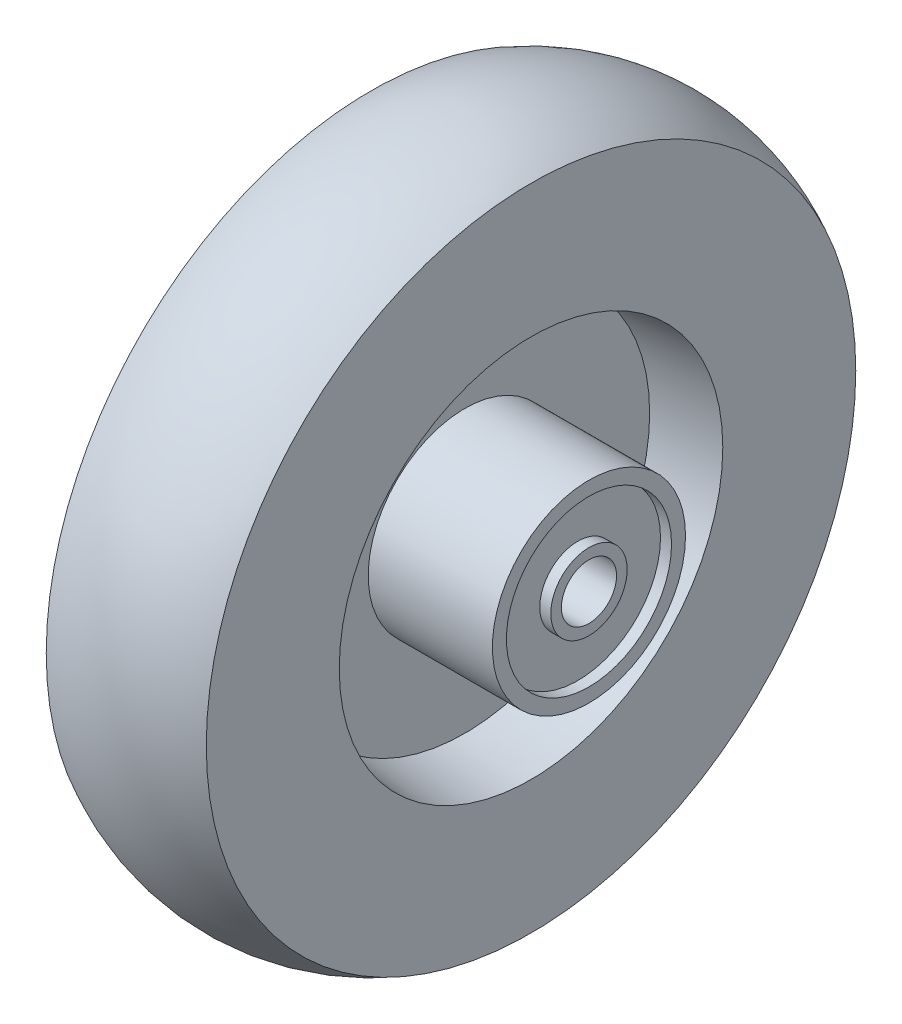
ISO-10303-21;
HEADER;
FILE_DESCRIPTION(('STEP AP214'),'2;1');
FILE_NAME('part.step','',(''),(''),'','','');
FILE_SCHEMA(('AUTOMOTIVE_DESIGN { 1 0 10303 214 1 1 1 1 }'));
ENDSEC;
DATA;
#1=APPLICATION_CONTEXT('core data for automotive mechanical design processes');
#2=APPLICATION_PROTOCOL_DEFINITION('international standard','automotive_design',2000,#1);
#3=PRODUCT_CONTEXT('',#1,'mechanical');
#4=PRODUCT('Part','Part','',(#3));
#5=PRODUCT_RELATED_PRODUCT_CATEGORY('part','',(#4));
#6=PRODUCT_DEFINITION_FORMATION('','',#4);
#7=PRODUCT_DEFINITION_CONTEXT('part definition',#1,'design');
#8=PRODUCT_DEFINITION('design','',#6,#7);
#9=PRODUCT_DEFINITION_SHAPE('','',#8);
#10=(LENGTH_UNIT() NAMED_UNIT(*) SI_UNIT(.MILLI.,.METRE.));
#11=(NAMED_UNIT(*) PLANE_ANGLE_UNIT() SI_UNIT($,.RADIAN.));
#12=(NAMED_UNIT(*) SI_UNIT($,.STERADIAN.) SOLID_ANGLE_UNIT());
#13=UNCERTAINTY_MEASURE_WITH_UNIT(LENGTH_MEASURE(1.E-05),#10,'distance_accuracy_value','');
#14=(GEOMETRIC_REPRESENTATION_CONTEXT(3) GLOBAL_UNCERTAINTY_ASSIGNED_CONTEXT((#13)) GLOBAL_UNIT_ASSIGNED_CONTEXT((#10,
#11,#12)) REPRESENTATION_CONTEXT('',''));
#15=CARTESIAN_POINT('',(0.,0.,0.));
#16=DIRECTION('',(0.,0.,1.));
#17=DIRECTION('',(1.,0.,0.));
#18=AXIS2_PLACEMENT_3D('',#15,#16,#17);
#19=CARTESIAN_POINT('',(-31.7499999999999,0.,-22.225));
#20=DIRECTION('',(-1.,0.,0.));
#21=DIRECTION('',(0.,0.,1.));
#22=AXIS2_PLACEMENT_3D('',#19,#20,#21);
#23=PLANE('',#22);
#24=CARTESIAN_POINT('',(-31.7500000000001,0.,0.));
#25=DIRECTION('',(1.,0.,0.));
#26=DIRECTION('',(0.,0.,-1.));
#27=AXIS2_PLACEMENT_3D('',#24,#25,#26);
#28=CIRCLE('',#27,22.225);
#29=CARTESIAN_POINT('',(-31.75,0.,-22.225));
#30=VERTEX_POINT('',#29);
#31=EDGE_CURVE('E10',#30,#30,#28,.T.);
#32=ORIENTED_EDGE('',*,*,#31,.F.);
#33=EDGE_LOOP('',(#32));
#34=FACE_BOUND('',#33,.T.);
#35=CARTESIAN_POINT('',(-31.75,0.,1.19944418344307E-13));
#36=DIRECTION('',(1.,0.,0.));
#37=DIRECTION('',(0.,0.,-1.));
#38=AXIS2_PLACEMENT_3D('',#35,#36,#37);
#39=CIRCLE('',#38,19.0018090386888);
#40=CARTESIAN_POINT('',(-31.75,0.,-19.0018090386887));
#41=VERTEX_POINT('',#40);
#42=EDGE_CURVE('E88',#41,#41,#39,.T.);
#43=ORIENTED_EDGE('',*,*,#42,.T.);
#44=EDGE_LOOP('',(#43));
#45=FACE_BOUND('',#44,.T.);
#46=ADVANCED_FACE('F31',(#34,#45),#23,.T.);
#47=CARTESIAN_POINT('',(-31.75,0.,0.));
#48=DIRECTION('',(1.,0.,0.));
#49=DIRECTION('',(0.,0.,-1.));
#50=AXIS2_PLACEMENT_3D('',#47,#48,#49);
#51=CYLINDRICAL_SURFACE('',#50,22.225);
#52=ORIENTED_EDGE('',*,*,#31,.T.);
#53=EDGE_LOOP('',(#52));
#54=FACE_BOUND('',#53,.T.);
#55=CARTESIAN_POINT('',(-3.17500000000006,0.,1.11838230097169E-13));
#56=DIRECTION('',(1.,0.,0.));
#57=DIRECTION('',(0.,0.,-1.));
#58=AXIS2_PLACEMENT_3D('',#55,#56,#57);
#59=CIRCLE('',#58,22.2250000000001);
#60=CARTESIAN_POINT('',(-3.17499999999998,0.,-22.225));
#61=VERTEX_POINT('',#60);
#62=EDGE_CURVE('E66',#61,#61,#59,.T.);
#63=ORIENTED_EDGE('',*,*,#62,.F.);
#64=EDGE_LOOP('',(#63));
#65=FACE_BOUND('',#64,.T.);
#66=ADVANCED_FACE('F33',(#54,#65),#51,.T.);
#67=CARTESIAN_POINT('',(-31.75,0.,1.19944418344307E-13));
#68=DIRECTION('',(1.,0.,0.));
#69=DIRECTION('',(0.,0.,-1.));
#70=AXIS2_PLACEMENT_3D('',#67,#68,#69);
#71=CIRCLE('',#70,8.78831894846454);
#72=CARTESIAN_POINT('',(-31.75,0.,-8.78831894846442));
#73=VERTEX_POINT('',#72);
#74=EDGE_CURVE('E94',#73,#73,#71,.T.);
#75=ORIENTED_EDGE('',*,*,#74,.F.);
#76=EDGE_LOOP('',(#75));
#77=FACE_BOUND('',#76,.T.);
#78=CARTESIAN_POINT('',(-31.7500000000003,0.,-1.19944418344308E-13));
#79=DIRECTION('',(1.,0.,0.));
#80=DIRECTION('',(0.,0.,-1.));
#81=AXIS2_PLACEMENT_3D('',#78,#79,#80);
#82=CIRCLE('',#81,6.35);
#83=CARTESIAN_POINT('',(-31.7500000000002,0.,-6.35000000000012));
#84=VERTEX_POINT('',#83);
#85=EDGE_CURVE('E79',#84,#84,#82,.T.);
#86=ORIENTED_EDGE('',*,*,#85,.T.);
#87=EDGE_LOOP('',(#86));
#88=FACE_BOUND('',#87,.T.);
#89=ADVANCED_FACE('F109',(#77,#88),#23,.T.);
#90=CARTESIAN_POINT('',(31.75,0.,-22.225));
#91=DIRECTION('',(1.,0.,0.));
#92=DIRECTION('',(0.,0.,-1.));
#93=AXIS2_PLACEMENT_3D('',#90,#91,#92);
#94=PLANE('',#93);
#95=CARTESIAN_POINT('',(31.75,0.,1.19944418344307E-13));
#96=DIRECTION('',(1.,0.,0.));
#97=DIRECTION('',(0.,0.,-1.));
#98=AXIS2_PLACEMENT_3D('',#95,#96,#97);
#99=CIRCLE('',#98,19.0018090386888);
#100=CARTESIAN_POINT('',(31.75,0.,-19.0018090386887));
#101=VERTEX_POINT('',#100);
#102=EDGE_CURVE('E70',#101,#101,#99,.T.);
#103=ORIENTED_EDGE('',*,*,#102,.F.);
#104=EDGE_LOOP('',(#103));
#105=FACE_BOUND('',#104,.T.);
#106=CARTESIAN_POINT('',(31.7499999999999,0.,2.43777090275907E-13));
#107=DIRECTION('',(1.,0.,0.));
#108=DIRECTION('',(0.,0.,-1.));
#109=AXIS2_PLACEMENT_3D('',#106,#107,#108);
#110=CIRCLE('',#109,22.2250000000002);
#111=CARTESIAN_POINT('',(31.75,0.,-22.225));
#112=VERTEX_POINT('',#111);
#113=EDGE_CURVE('E38',#112,#112,#110,.T.);
#114=ORIENTED_EDGE('',*,*,#113,.T.);
#115=EDGE_LOOP('',(#114));
#116=FACE_BOUND('',#115,.T.);
#117=ADVANCED_FACE('F112',(#105,#116),#94,.T.);
#118=CARTESIAN_POINT('',(-31.75,0.,0.));
#119=DIRECTION('',(1.,0.,0.));
#120=DIRECTION('',(0.,0.,-1.));
#121=AXIS2_PLACEMENT_3D('',#118,#119,#120);
#122=CYLINDRICAL_SURFACE('',#121,22.2250000000001);
#123=CARTESIAN_POINT('',(3.17499999999991,0.,1.3582711376603E-13));
#124=DIRECTION('',(1.,0.,0.));
#125=DIRECTION('',(0.,0.,-1.));
#126=AXIS2_PLACEMENT_3D('',#123,#124,#125);
#127=CIRCLE('',#126,22.2250000000001);
#128=CARTESIAN_POINT('',(3.175,0.,-22.225));
#129=VERTEX_POINT('',#128);
#130=EDGE_CURVE('E42',#129,#129,#127,.T.);
#131=ORIENTED_EDGE('',*,*,#130,.T.);
#132=EDGE_LOOP('',(#131));
#133=FACE_BOUND('',#132,.T.);
#134=ORIENTED_EDGE('',*,*,#113,.F.);
#135=EDGE_LOOP('',(#134));
#136=FACE_BOUND('',#135,.T.);
#137=ADVANCED_FACE('F146',(#133,#136),#122,.T.);
#138=CARTESIAN_POINT('',(3.17500000000004,0.,-42.545));
#139=DIRECTION('',(1.,0.,0.));
#140=DIRECTION('',(0.,0.,-1.));
#141=AXIS2_PLACEMENT_3D('',#138,#139,#140);
#142=PLANE('',#141);
#143=CARTESIAN_POINT('',(3.17499999999984,0.,1.3582711376603E-13));
#144=DIRECTION('',(1.,0.,0.));
#145=DIRECTION('',(0.,0.,-1.));
#146=AXIS2_PLACEMENT_3D('',#143,#144,#145);
#147=CIRCLE('',#146,42.5450000000001);
#148=CARTESIAN_POINT('',(3.175,0.,-42.545));
#149=VERTEX_POINT('',#148);
#150=EDGE_CURVE('E46',#149,#149,#147,.T.);
#151=ORIENTED_EDGE('',*,*,#150,.T.);
#152=EDGE_LOOP('',(#151));
#153=FACE_BOUND('',#152,.T.);
#154=ORIENTED_EDGE('',*,*,#130,.F.);
#155=EDGE_LOOP('',(#154));
#156=FACE_BOUND('',#155,.T.);
#157=ADVANCED_FACE('F150',(#153,#156),#142,.T.);
#158=CARTESIAN_POINT('',(3.17499999999984,0.,1.3582711376603E-13));
#159=DIRECTION('',(1.,0.,0.));
#160=DIRECTION('',(0.,0.,-1.));
#161=AXIS2_PLACEMENT_3D('',#158,#159,#160);
#162=CONICAL_SURFACE('',#161,42.5450000000001,0.104023410740803);
#163=CARTESIAN_POINT('',(18.4149999999998,0.,1.93400434571297E-13));
#164=DIRECTION('',(1.,0.,0.));
#165=DIRECTION('',(0.,0.,-1.));
#166=AXIS2_PLACEMENT_3D('',#163,#164,#165);
#167=CIRCLE('',#166,44.1360598077131);
#168=CARTESIAN_POINT('',(18.415,0.,-44.1360598077129));
#169=VERTEX_POINT('',#168);
#170=EDGE_CURVE('E51',#169,#169,#167,.T.);
#171=ORIENTED_EDGE('',*,*,#170,.T.);
#172=EDGE_LOOP('',(#171));
#173=FACE_BOUND('',#172,.T.);
#174=ORIENTED_EDGE('',*,*,#150,.F.);
#175=EDGE_LOOP('',(#174));
#176=FACE_BOUND('',#175,.T.);
#177=ADVANCED_FACE('F154',(#173,#176),#162,.F.);
#178=CARTESIAN_POINT('',(18.4150000000001,0.,-74.7374332516839));
#179=DIRECTION('',(1.,0.,0.));
#180=DIRECTION('',(0.,0.,-1.));
#181=AXIS2_PLACEMENT_3D('',#178,#179,#180);
#182=PLANE('',#181);
#183=CARTESIAN_POINT('',(18.4149999999997,0.,1.93400434571297E-13));
#184=DIRECTION('',(1.,0.,0.));
#185=DIRECTION('',(0.,0.,-1.));
#186=AXIS2_PLACEMENT_3D('',#183,#184,#185);
#187=CIRCLE('',#186,74.7374332516841);
#188=CARTESIAN_POINT('',(18.415,0.,-74.7374332516839));
#189=VERTEX_POINT('',#188);
#190=EDGE_CURVE('E54',#189,#189,#187,.T.);
#191=ORIENTED_EDGE('',*,*,#190,.T.);
#192=EDGE_LOOP('',(#191));
#193=FACE_BOUND('',#192,.T.);
#194=ORIENTED_EDGE('',*,*,#170,.F.);
#195=EDGE_LOOP('',(#194));
#196=FACE_BOUND('',#195,.T.);
#197=ADVANCED_FACE('F158',(#193,#196),#182,.T.);
#198=CARTESIAN_POINT('',(-1.36283359717873E-13,0.,1.2490009027033E-13));
#199=DIRECTION('',(1.,0.,0.));
#200=DIRECTION('',(0.,0.,-1.));
#201=AXIS2_PLACEMENT_3D('',#198,#199,#200);
#202=TOROIDAL_SURFACE('',#201,40.4947779011991,38.880222098801);
#203=CARTESIAN_POINT('',(-18.4150000000003,0.,0.));
#204=DIRECTION('',(1.,0.,0.));
#205=DIRECTION('',(0.,0.,-1.));
#206=AXIS2_PLACEMENT_3D('',#203,#204,#205);
#207=CIRCLE('',#206,74.7374332516839);
#208=CARTESIAN_POINT('',(-18.415,0.,-74.7374332516838));
#209=VERTEX_POINT('',#208);
#210=EDGE_CURVE('E57',#209,#209,#207,.T.);
#211=ORIENTED_EDGE('',*,*,#210,.T.);
#212=EDGE_LOOP('',(#211));
#213=FACE_BOUND('',#212,.T.);
#214=ORIENTED_EDGE('',*,*,#190,.F.);
#215=EDGE_LOOP('',(#214));
#216=FACE_BOUND('',#215,.T.);
#217=ADVANCED_FACE('F162',(#213,#216),#202,.T.);
#218=CARTESIAN_POINT('',(-18.4149999999999,0.,-74.7374332516838));
#219=DIRECTION('',(-1.,0.,0.));
#220=DIRECTION('',(0.,0.,1.));
#221=AXIS2_PLACEMENT_3D('',#218,#219,#220);
#222=PLANE('',#221);
#223=CARTESIAN_POINT('',(-18.4150000000001,0.,0.));
#224=DIRECTION('',(1.,0.,0.));
#225=DIRECTION('',(0.,0.,-1.));
#226=AXIS2_PLACEMENT_3D('',#223,#224,#225);
#227=CIRCLE('',#226,44.136059807713);
#228=CARTESIAN_POINT('',(-18.4149999999999,0.,-44.1360598077129));
#229=VERTEX_POINT('',#228);
#230=EDGE_CURVE('E60',#229,#229,#227,.T.);
#231=ORIENTED_EDGE('',*,*,#230,.T.);
#232=EDGE_LOOP('',(#231));
#233=FACE_BOUND('',#232,.T.);
#234=ORIENTED_EDGE('',*,*,#210,.F.);
#235=EDGE_LOOP('',(#234));
#236=FACE_BOUND('',#235,.T.);
#237=ADVANCED_FACE('F166',(#233,#236),#222,.T.);
#238=CARTESIAN_POINT('',(-18.4150000000001,0.,0.));
#239=DIRECTION('',(-1.,0.,0.));
#240=DIRECTION('',(0.,0.,1.));
#241=AXIS2_PLACEMENT_3D('',#238,#239,#240);
#242=CONICAL_SURFACE('',#241,44.136059807713,0.104023410740796);
#243=CARTESIAN_POINT('',(-3.17500000000014,0.,1.11838230097169E-13));
#244=DIRECTION('',(1.,0.,0.));
#245=DIRECTION('',(0.,0.,-1.));
#246=AXIS2_PLACEMENT_3D('',#243,#244,#245);
#247=CIRCLE('',#246,42.5450000000001);
#248=CARTESIAN_POINT('',(-3.17499999999998,0.,-42.545));
#249=VERTEX_POINT('',#248);
#250=EDGE_CURVE('E63',#249,#249,#247,.T.);
#251=ORIENTED_EDGE('',*,*,#250,.T.);
#252=EDGE_LOOP('',(#251));
#253=FACE_BOUND('',#252,.T.);
#254=ORIENTED_EDGE('',*,*,#230,.F.);
#255=EDGE_LOOP('',(#254));
#256=FACE_BOUND('',#255,.T.);
#257=ADVANCED_FACE('F170',(#253,#256),#242,.F.);
#258=CARTESIAN_POINT('',(-3.17499999999994,0.,-42.545));
#259=DIRECTION('',(-1.,0.,0.));
#260=DIRECTION('',(0.,0.,1.));
#261=AXIS2_PLACEMENT_3D('',#258,#259,#260);
#262=PLANE('',#261);
#263=ORIENTED_EDGE('',*,*,#62,.T.);
#264=EDGE_LOOP('',(#263));
#265=FACE_BOUND('',#264,.T.);
#266=ORIENTED_EDGE('',*,*,#250,.F.);
#267=EDGE_LOOP('',(#266));
#268=FACE_BOUND('',#267,.T.);
#269=ADVANCED_FACE('F174',(#265,#268),#262,.T.);
#270=CARTESIAN_POINT('',(29.21,0.,1.10348864876762E-13));
#271=DIRECTION('',(1.,0.,0.));
#272=DIRECTION('',(0.,0.,-1.));
#273=AXIS2_PLACEMENT_3D('',#270,#271,#272);
#274=CYLINDRICAL_SURFACE('',#273,19.0018090386888);
#275=CARTESIAN_POINT('',(29.21,0.,1.10348864876762E-13));
#276=DIRECTION('',(1.,0.,0.));
#277=DIRECTION('',(0.,0.,-1.));
#278=AXIS2_PLACEMENT_3D('',#275,#276,#277);
#279=CIRCLE('',#278,19.0018090386888);
#280=CARTESIAN_POINT('',(29.21,0.,-19.0018090386887));
#281=VERTEX_POINT('',#280);
#282=EDGE_CURVE('E69',#281,#281,#279,.T.);
#283=ORIENTED_EDGE('',*,*,#282,.F.);
#284=EDGE_LOOP('',(#283));
#285=FACE_BOUND('',#284,.T.);
#286=ORIENTED_EDGE('',*,*,#102,.T.);
#287=EDGE_LOOP('',(#286));
#288=FACE_BOUND('',#287,.T.);
#289=ADVANCED_FACE('F135',(#285,#288),#274,.F.);
#290=CARTESIAN_POINT('',(29.21,0.,1.10348864876762E-13));
#291=DIRECTION('',(1.,0.,0.));
#292=DIRECTION('',(0.,0.,-1.));
#293=AXIS2_PLACEMENT_3D('',#290,#291,#292);
#294=PLANE('',#293);
#295=CARTESIAN_POINT('',(29.21,0.,1.10348864876762E-13));
#296=DIRECTION('',(1.,0.,0.));
#297=DIRECTION('',(0.,0.,-1.));
#298=AXIS2_PLACEMENT_3D('',#295,#296,#297);
#299=CIRCLE('',#298,8.78831894846454);
#300=CARTESIAN_POINT('',(29.21,0.,-8.78831894846443));
#301=VERTEX_POINT('',#300);
#302=EDGE_CURVE('E73',#301,#301,#299,.T.);
#303=ORIENTED_EDGE('',*,*,#302,.F.);
#304=EDGE_LOOP('',(#303));
#305=FACE_BOUND('',#304,.T.);
#306=ORIENTED_EDGE('',*,*,#282,.T.);
#307=EDGE_LOOP('',(#306));
#308=FACE_BOUND('',#307,.T.);
#309=ADVANCED_FACE('F129',(#305,#308),#294,.T.);
#310=CARTESIAN_POINT('',(29.21,0.,1.10348864876762E-13));
#311=DIRECTION('',(1.,0.,0.));
#312=DIRECTION('',(0.,0.,-1.));
#313=AXIS2_PLACEMENT_3D('',#310,#311,#312);
#314=CYLINDRICAL_SURFACE('',#313,8.78831894846454);
#315=ORIENTED_EDGE('',*,*,#302,.T.);
#316=EDGE_LOOP('',(#315));
#317=FACE_BOUND('',#316,.T.);
#318=CARTESIAN_POINT('',(31.75,0.,1.19944418344307E-13));
#319=DIRECTION('',(1.,0.,0.));
#320=DIRECTION('',(0.,0.,-1.));
#321=AXIS2_PLACEMENT_3D('',#318,#319,#320);
#322=CIRCLE('',#321,8.78831894846454);
#323=CARTESIAN_POINT('',(31.75,0.,-8.78831894846442));
#324=VERTEX_POINT('',#323);
#325=EDGE_CURVE('E76',#324,#324,#322,.T.);
#326=ORIENTED_EDGE('',*,*,#325,.F.);
#327=EDGE_LOOP('',(#326));
#328=FACE_BOUND('',#327,.T.);
#329=ADVANCED_FACE('F124',(#317,#328),#314,.T.);
#330=CARTESIAN_POINT('',(31.75,0.,1.19944418344307E-13));
#331=DIRECTION('',(1.,0.,0.));
#332=DIRECTION('',(0.,0.,-1.));
#333=AXIS2_PLACEMENT_3D('',#330,#331,#332);
#334=CIRCLE('',#333,6.35);
#335=CARTESIAN_POINT('',(31.75,0.,-6.34999999999988));
#336=VERTEX_POINT('',#335);
#337=EDGE_CURVE('E82',#336,#336,#334,.T.);
#338=ORIENTED_EDGE('',*,*,#337,.F.);
#339=EDGE_LOOP('',(#338));
#340=FACE_BOUND('',#339,.T.);
#341=ORIENTED_EDGE('',*,*,#325,.T.);
#342=EDGE_LOOP('',(#341));
#343=FACE_BOUND('',#342,.T.);
#344=ADVANCED_FACE('F118',(#340,#343),#94,.T.);
#345=CARTESIAN_POINT('',(-31.7500000000003,0.,-1.19944418344308E-13));
#346=DIRECTION('',(1.,0.,0.));
#347=DIRECTION('',(0.,0.,-1.));
#348=AXIS2_PLACEMENT_3D('',#345,#346,#347);
#349=CYLINDRICAL_SURFACE('',#348,6.35);
#350=ORIENTED_EDGE('',*,*,#85,.F.);
#351=EDGE_LOOP('',(#350));
#352=FACE_BOUND('',#351,.T.);
#353=ORIENTED_EDGE('',*,*,#337,.T.);
#354=EDGE_LOOP('',(#353));
#355=FACE_BOUND('',#354,.T.);
#356=ADVANCED_FACE('F115',(#352,#355),#349,.F.);
#357=CARTESIAN_POINT('',(-29.21,0.,1.10348864876762E-13));
#358=DIRECTION('',(-1.,0.,0.));
#359=DIRECTION('',(0.,0.,-1.));
#360=AXIS2_PLACEMENT_3D('',#357,#358,#359);
#361=PLANE('',#360);
#362=CARTESIAN_POINT('',(-29.21,0.,1.10348864876762E-13));
#363=DIRECTION('',(1.,0.,0.));
#364=DIRECTION('',(0.,0.,-1.));
#365=AXIS2_PLACEMENT_3D('',#362,#363,#364);
#366=CIRCLE('',#365,19.0018090386888);
#367=CARTESIAN_POINT('',(-29.21,0.,-19.0018090386887));
#368=VERTEX_POINT('',#367);
#369=EDGE_CURVE('E85',#368,#368,#366,.T.);
#370=ORIENTED_EDGE('',*,*,#369,.F.);
#371=EDGE_LOOP('',(#370));
#372=FACE_BOUND('',#371,.T.);
#373=CARTESIAN_POINT('',(-29.21,0.,1.10348864876762E-13));
#374=DIRECTION('',(1.,0.,0.));
#375=DIRECTION('',(0.,0.,-1.));
#376=AXIS2_PLACEMENT_3D('',#373,#374,#375);
#377=CIRCLE('',#376,8.78831894846454);
#378=CARTESIAN_POINT('',(-29.21,0.,-8.78831894846443));
#379=VERTEX_POINT('',#378);
#380=EDGE_CURVE('E91',#379,#379,#377,.T.);
#381=ORIENTED_EDGE('',*,*,#380,.T.);
#382=EDGE_LOOP('',(#381));
#383=FACE_BOUND('',#382,.T.);
#384=ADVANCED_FACE('F100',(#372,#383),#361,.T.);
#385=CARTESIAN_POINT('',(-29.21,0.,1.10348864876762E-13));
#386=DIRECTION('',(-1.,0.,0.));
#387=DIRECTION('',(0.,0.,1.));
#388=AXIS2_PLACEMENT_3D('',#385,#386,#387);
#389=CYLINDRICAL_SURFACE('',#388,19.0018090386888);
#390=ORIENTED_EDGE('',*,*,#369,.T.);
#391=EDGE_LOOP('',(#390));
#392=FACE_BOUND('',#391,.T.);
#393=ORIENTED_EDGE('',*,*,#42,.F.);
#394=EDGE_LOOP('',(#393));
#395=FACE_BOUND('',#394,.T.);
#396=ADVANCED_FACE('F105',(#392,#395),#389,.F.);
#397=CARTESIAN_POINT('',(-29.21,0.,1.10348864876762E-13));
#398=DIRECTION('',(-1.,0.,0.));
#399=DIRECTION('',(0.,0.,1.));
#400=AXIS2_PLACEMENT_3D('',#397,#398,#399);
#401=CYLINDRICAL_SURFACE('',#400,8.78831894846454);
#402=ORIENTED_EDGE('',*,*,#380,.F.);
#403=EDGE_LOOP('',(#402));
#404=FACE_BOUND('',#403,.T.);
#405=ORIENTED_EDGE('',*,*,#74,.T.);
#406=EDGE_LOOP('',(#405));
#407=FACE_BOUND('',#406,.T.);
#408=ADVANCED_FACE('F102',(#404,#407),#401,.T.);
#409=CLOSED_SHELL('',(#46,#66,#89,#117,#137,#157,#177,#197,#217,#237,#257,#269,#289,#309,#329,
#344,#356,#384,#396,#408));
#410=MANIFOLD_SOLID_BREP('B2',#409);
#411=ADVANCED_BREP_SHAPE_REPRESENTATION('',(#18,#410),#14);
#412=SHAPE_DEFINITION_REPRESENTATION(#9,#411);
ENDSEC;
END-ISO-10303-21;
